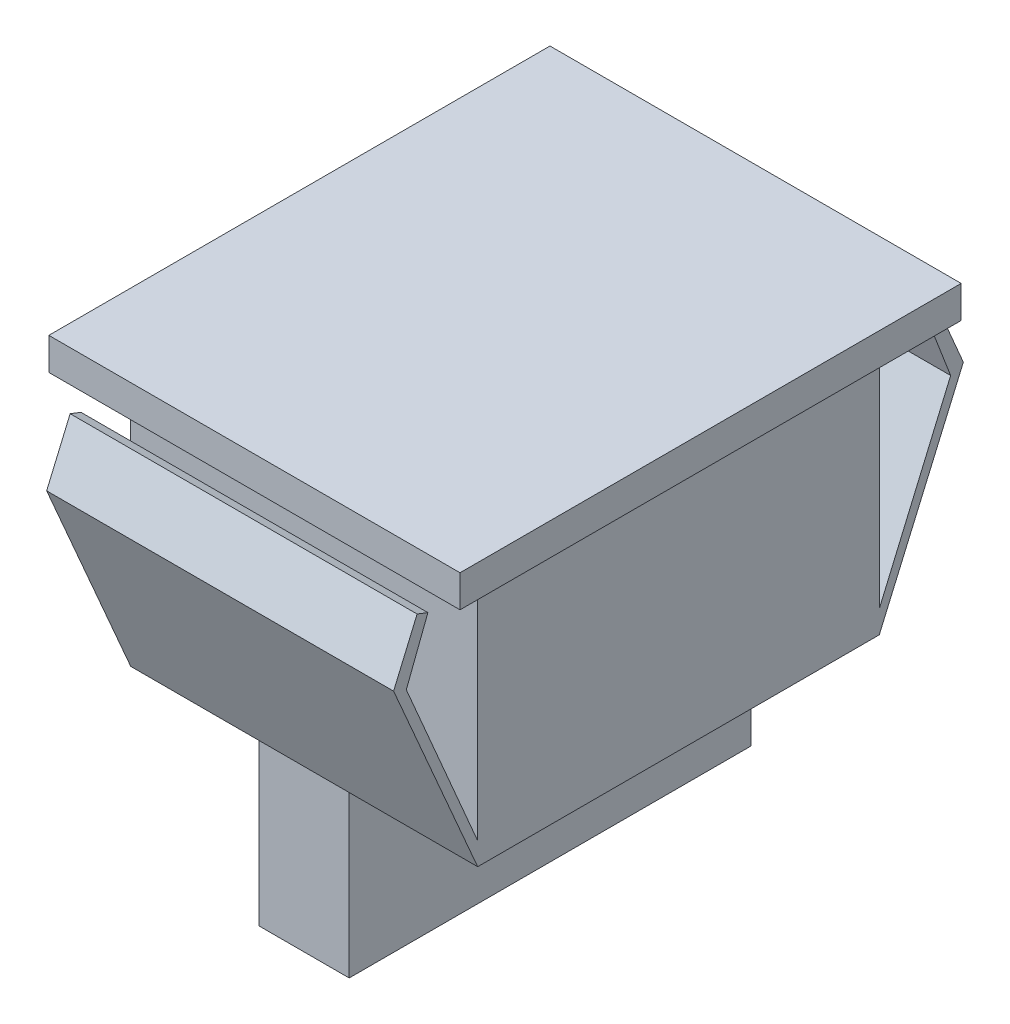
ISO-10303-21;
HEADER;
FILE_DESCRIPTION(('STEP AP214'),'2;1');
FILE_NAME('part.step','',(''),(''),'','','');
FILE_SCHEMA(('AUTOMOTIVE_DESIGN { 1 0 10303 214 1 1 1 1 }'));
ENDSEC;
DATA;
#1=APPLICATION_CONTEXT('core data for automotive mechanical design processes');
#2=APPLICATION_PROTOCOL_DEFINITION('international standard','automotive_design',2000,#1);
#3=PRODUCT_CONTEXT('',#1,'mechanical');
#4=PRODUCT('Part','Part','',(#3));
#5=PRODUCT_RELATED_PRODUCT_CATEGORY('part','',(#4));
#6=PRODUCT_DEFINITION_FORMATION('','',#4);
#7=PRODUCT_DEFINITION_CONTEXT('part definition',#1,'design');
#8=PRODUCT_DEFINITION('design','',#6,#7);
#9=PRODUCT_DEFINITION_SHAPE('','',#8);
#10=(LENGTH_UNIT() NAMED_UNIT(*) SI_UNIT(.MILLI.,.METRE.));
#11=(NAMED_UNIT(*) PLANE_ANGLE_UNIT() SI_UNIT($,.RADIAN.));
#12=(NAMED_UNIT(*) SI_UNIT($,.STERADIAN.) SOLID_ANGLE_UNIT());
#13=UNCERTAINTY_MEASURE_WITH_UNIT(LENGTH_MEASURE(1.E-05),#10,'distance_accuracy_value','');
#14=(GEOMETRIC_REPRESENTATION_CONTEXT(3) GLOBAL_UNCERTAINTY_ASSIGNED_CONTEXT((#13)) GLOBAL_UNIT_ASSIGNED_CONTEXT((#10,
#11,#12)) REPRESENTATION_CONTEXT('',''));
#15=CARTESIAN_POINT('',(0.,0.,0.));
#16=DIRECTION('',(0.,0.,1.));
#17=DIRECTION('',(1.,0.,0.));
#18=AXIS2_PLACEMENT_3D('',#15,#16,#17);
#19=CARTESIAN_POINT('',(25.6,0.,12.5));
#20=DIRECTION('',(0.,0.,-1.));
#21=DIRECTION('',(-1.,0.,0.));
#22=AXIS2_PLACEMENT_3D('',#19,#20,#21);
#23=PLANE('',#22);
#24=DIRECTION('',(0.,-1.,0.));
#25=VECTOR('',#24,1.);
#26=CARTESIAN_POINT('',(15.6,0.,12.5));
#27=LINE('',#26,#25);
#28=CARTESIAN_POINT('',(15.6,10.,12.5));
#29=VERTEX_POINT('',#28);
#30=CARTESIAN_POINT('',(15.6,0.,12.5));
#31=VERTEX_POINT('',#30);
#32=EDGE_CURVE('E405',#29,#31,#27,.T.);
#33=ORIENTED_EDGE('',*,*,#32,.F.);
#34=DIRECTION('',(-1.,0.,0.));
#35=VECTOR('',#34,1.);
#36=CARTESIAN_POINT('',(25.6,10.,12.5));
#37=LINE('',#36,#35);
#38=CARTESIAN_POINT('',(10.,10.,12.5));
#39=VERTEX_POINT('',#38);
#40=EDGE_CURVE('E242',#29,#39,#37,.T.);
#41=ORIENTED_EDGE('',*,*,#40,.T.);
#42=DIRECTION('',(0.,1.,0.));
#43=VECTOR('',#42,1.);
#44=CARTESIAN_POINT('',(10.,0.,12.5));
#45=LINE('',#44,#43);
#46=CARTESIAN_POINT('',(10.,0.,12.5));
#47=VERTEX_POINT('',#46);
#48=EDGE_CURVE('E403',#47,#39,#45,.T.);
#49=ORIENTED_EDGE('',*,*,#48,.F.);
#50=DIRECTION('',(-1.,0.,0.));
#51=VECTOR('',#50,1.);
#52=CARTESIAN_POINT('',(25.6,0.,12.5));
#53=LINE('',#52,#51);
#54=EDGE_CURVE('E301',#31,#47,#53,.T.);
#55=ORIENTED_EDGE('',*,*,#54,.F.);
#56=EDGE_LOOP('',(#33,#41,#49,#55));
#57=FACE_BOUND('',#56,.T.);
#58=ADVANCED_FACE('F34',(#57),#23,.F.);
#59=CARTESIAN_POINT('',(25.6,0.,-12.5));
#60=DIRECTION('',(0.,1.,0.));
#61=DIRECTION('',(0.,0.,1.));
#62=AXIS2_PLACEMENT_3D('',#59,#60,#61);
#63=PLANE('',#62);
#64=DIRECTION('',(0.,0.,1.));
#65=VECTOR('',#64,1.);
#66=CARTESIAN_POINT('',(15.6,0.,-17.7359073275508));
#67=LINE('',#66,#65);
#68=CARTESIAN_POINT('',(15.6,0.,-12.5));
#69=VERTEX_POINT('',#68);
#70=EDGE_CURVE('E320',#69,#31,#67,.T.);
#71=ORIENTED_EDGE('',*,*,#70,.T.);
#72=ORIENTED_EDGE('',*,*,#54,.T.);
#73=DIRECTION('',(0.,0.,1.));
#74=VECTOR('',#73,1.);
#75=CARTESIAN_POINT('',(10.,0.,-17.7359073275508));
#76=LINE('',#75,#74);
#77=CARTESIAN_POINT('',(10.,0.,-12.5));
#78=VERTEX_POINT('',#77);
#79=EDGE_CURVE('E309',#78,#47,#76,.T.);
#80=ORIENTED_EDGE('',*,*,#79,.F.);
#81=DIRECTION('',(-1.,0.,0.));
#82=VECTOR('',#81,1.);
#83=CARTESIAN_POINT('',(25.6,0.,-12.5));
#84=LINE('',#83,#82);
#85=EDGE_CURVE('E298',#69,#78,#84,.T.);
#86=ORIENTED_EDGE('',*,*,#85,.F.);
#87=EDGE_LOOP('',(#71,#72,#80,#86));
#88=FACE_BOUND('',#87,.T.);
#89=ADVANCED_FACE('F318',(#88),#63,.F.);
#90=CARTESIAN_POINT('',(25.6,0.,-12.5));
#91=DIRECTION('',(0.,0.,1.));
#92=DIRECTION('',(1.,0.,0.));
#93=AXIS2_PLACEMENT_3D('',#90,#91,#92);
#94=PLANE('',#93);
#95=DIRECTION('',(0.,1.,0.));
#96=VECTOR('',#95,1.);
#97=CARTESIAN_POINT('',(15.6,0.,-12.5));
#98=LINE('',#97,#96);
#99=CARTESIAN_POINT('',(15.6,10.,-12.5));
#100=VERTEX_POINT('',#99);
#101=EDGE_CURVE('E12',#69,#100,#98,.T.);
#102=ORIENTED_EDGE('',*,*,#101,.F.);
#103=ORIENTED_EDGE('',*,*,#85,.T.);
#104=DIRECTION('',(0.,-1.,0.));
#105=VECTOR('',#104,1.);
#106=CARTESIAN_POINT('',(10.,0.,-12.5));
#107=LINE('',#106,#105);
#108=CARTESIAN_POINT('',(10.,10.,-12.5));
#109=VERTEX_POINT('',#108);
#110=EDGE_CURVE('E42',#109,#78,#107,.T.);
#111=ORIENTED_EDGE('',*,*,#110,.F.);
#112=DIRECTION('',(-1.,0.,0.));
#113=VECTOR('',#112,1.);
#114=CARTESIAN_POINT('',(25.6,10.,-12.5));
#115=LINE('',#114,#113);
#116=EDGE_CURVE('E295',#100,#109,#115,.T.);
#117=ORIENTED_EDGE('',*,*,#116,.F.);
#118=EDGE_LOOP('',(#102,#103,#111,#117));
#119=FACE_BOUND('',#118,.T.);
#120=ADVANCED_FACE('F323',(#119),#94,.F.);
#121=CARTESIAN_POINT('',(25.6,10.,-12.5));
#122=DIRECTION('',(0.,0.39753032988363,0.917589034820389));
#123=DIRECTION('',(0.,-0.917589034820389,0.39753032988363));
#124=AXIS2_PLACEMENT_3D('',#121,#122,#123);
#125=PLANE('',#124);
#126=DIRECTION('',(0.,-0.917589034820389,0.39753032988363));
#127=VECTOR('',#126,1.);
#128=CARTESIAN_POINT('',(2.,10.,-12.5));
#129=LINE('',#128,#127);
#130=CARTESIAN_POINT('',(2.,22.0856467794615,-17.7359073275508));
#131=VERTEX_POINT('',#130);
#132=CARTESIAN_POINT('',(2.,10.,-12.5));
#133=VERTEX_POINT('',#132);
#134=EDGE_CURVE('E399',#131,#133,#129,.T.);
#135=ORIENTED_EDGE('',*,*,#134,.F.);
#136=DIRECTION('',(-1.,0.,0.));
#137=VECTOR('',#136,1.);
#138=CARTESIAN_POINT('',(25.6,22.0856467794615,-17.7359073275508));
#139=LINE('',#138,#137);
#140=CARTESIAN_POINT('',(23.6,22.0856467794615,-17.7359073275508));
#141=VERTEX_POINT('',#140);
#142=EDGE_CURVE('E292',#141,#131,#139,.T.);
#143=ORIENTED_EDGE('',*,*,#142,.F.);
#144=DIRECTION('',(0.,0.917589034820389,-0.39753032988363));
#145=VECTOR('',#144,1.);
#146=CARTESIAN_POINT('',(23.6,10.,-12.5));
#147=LINE('',#146,#145);
#148=CARTESIAN_POINT('',(23.6,10.,-12.5));
#149=VERTEX_POINT('',#148);
#150=EDGE_CURVE('E233',#149,#141,#147,.T.);
#151=ORIENTED_EDGE('',*,*,#150,.F.);
#152=DIRECTION('',(1.,0.,0.));
#153=VECTOR('',#152,1.);
#154=CARTESIAN_POINT('',(25.6,10.,-12.5));
#155=LINE('',#154,#153);
#156=EDGE_CURVE('E334',#100,#149,#155,.T.);
#157=ORIENTED_EDGE('',*,*,#156,.F.);
#158=ORIENTED_EDGE('',*,*,#116,.T.);
#159=DIRECTION('',(1.,0.,0.));
#160=VECTOR('',#159,1.);
#161=CARTESIAN_POINT('',(25.6,10.,-12.5));
#162=LINE('',#161,#160);
#163=EDGE_CURVE('E401',#133,#109,#162,.T.);
#164=ORIENTED_EDGE('',*,*,#163,.F.);
#165=EDGE_LOOP('',(#135,#143,#151,#157,#158,#164));
#166=FACE_BOUND('',#165,.T.);
#167=ADVANCED_FACE('F456',(#166),#125,.F.);
#168=CARTESIAN_POINT('',(25.6,22.0856467794615,-17.7359073275508));
#169=DIRECTION('',(0.,-0.392989074289945,0.91954314063492));
#170=DIRECTION('',(0.,-0.91954314063492,-0.392989074289945));
#171=AXIS2_PLACEMENT_3D('',#168,#169,#170);
#172=PLANE('',#171);
#173=DIRECTION('',(0.,-0.91954314063492,-0.392989074289945));
#174=VECTOR('',#173,1.);
#175=CARTESIAN_POINT('',(2.,22.0856467794615,-17.7359073275508));
#176=LINE('',#175,#174);
#177=CARTESIAN_POINT('',(2.,25.5104759417191,-16.2722234799964));
#178=VERTEX_POINT('',#177);
#179=EDGE_CURVE('E397',#178,#131,#176,.T.);
#180=ORIENTED_EDGE('',*,*,#179,.F.);
#181=DIRECTION('',(-1.,0.,0.));
#182=VECTOR('',#181,1.);
#183=CARTESIAN_POINT('',(25.6,25.5104759417191,-16.2722234799964));
#184=LINE('',#183,#182);
#185=CARTESIAN_POINT('',(23.6,25.5104759417191,-16.2722234799964));
#186=VERTEX_POINT('',#185);
#187=EDGE_CURVE('E289',#186,#178,#184,.T.);
#188=ORIENTED_EDGE('',*,*,#187,.F.);
#189=DIRECTION('',(0.,0.91954314063492,0.392989074289945));
#190=VECTOR('',#189,1.);
#191=CARTESIAN_POINT('',(23.6,22.0856467794615,-17.7359073275508));
#192=LINE('',#191,#190);
#193=EDGE_CURVE('E371',#141,#186,#192,.T.);
#194=ORIENTED_EDGE('',*,*,#193,.F.);
#195=ORIENTED_EDGE('',*,*,#142,.T.);
#196=EDGE_LOOP('',(#180,#188,#194,#195));
#197=FACE_BOUND('',#196,.T.);
#198=ADVANCED_FACE('F466',(#197),#172,.F.);
#199=CARTESIAN_POINT('',(25.6,25.5104759417191,-16.2722234799964));
#200=DIRECTION('',(0.,-0.93314071810577,-0.359511335305367));
#201=DIRECTION('',(0.,0.359511335305367,-0.93314071810577));
#202=AXIS2_PLACEMENT_3D('',#199,#200,#201);
#203=PLANE('',#202);
#204=DIRECTION('',(0.,0.359511335305367,-0.93314071810577));
#205=VECTOR('',#204,1.);
#206=CARTESIAN_POINT('',(2.,25.5104759417191,-16.2722234799964));
#207=LINE('',#206,#205);
#208=CARTESIAN_POINT('',(2.,25.2514882496937,-15.6));
#209=VERTEX_POINT('',#208);
#210=EDGE_CURVE('E395',#209,#178,#207,.T.);
#211=ORIENTED_EDGE('',*,*,#210,.F.);
#212=DIRECTION('',(-1.,0.,0.));
#213=VECTOR('',#212,1.);
#214=CARTESIAN_POINT('',(25.6,25.2514882496937,-15.6));
#215=LINE('',#214,#213);
#216=CARTESIAN_POINT('',(23.6,25.2514882496937,-15.6));
#217=VERTEX_POINT('',#216);
#218=EDGE_CURVE('E286',#217,#209,#215,.T.);
#219=ORIENTED_EDGE('',*,*,#218,.F.);
#220=DIRECTION('',(0.,-0.359511335305367,0.93314071810577));
#221=VECTOR('',#220,1.);
#222=CARTESIAN_POINT('',(23.6,25.5104759417191,-16.2722234799964));
#223=LINE('',#222,#221);
#224=EDGE_CURVE('E369',#186,#217,#223,.T.);
#225=ORIENTED_EDGE('',*,*,#224,.F.);
#226=ORIENTED_EDGE('',*,*,#187,.T.);
#227=EDGE_LOOP('',(#211,#219,#225,#226));
#228=FACE_BOUND('',#227,.T.);
#229=ADVANCED_FACE('F469',(#228),#203,.F.);
#230=CARTESIAN_POINT('',(25.6,25.2514882496937,-15.6));
#231=DIRECTION('',(0.,0.359511335305367,-0.93314071810577));
#232=DIRECTION('',(0.,0.93314071810577,0.359511335305367));
#233=AXIS2_PLACEMENT_3D('',#230,#231,#232);
#234=PLANE('',#233);
#235=DIRECTION('',(0.,0.93314071810577,0.359511335305367));
#236=VECTOR('',#235,1.);
#237=CARTESIAN_POINT('',(2.,25.2514882496937,-15.6));
#238=LINE('',#237,#236);
#239=CARTESIAN_POINT('',(2.,21.7618675381877,-16.9444469599928));
#240=VERTEX_POINT('',#239);
#241=EDGE_CURVE('E393',#240,#209,#238,.T.);
#242=ORIENTED_EDGE('',*,*,#241,.F.);
#243=DIRECTION('',(-1.,0.,0.));
#244=VECTOR('',#243,1.);
#245=CARTESIAN_POINT('',(25.6,21.7618675381877,-16.9444469599928));
#246=LINE('',#245,#244);
#247=CARTESIAN_POINT('',(23.6,21.7618675381877,-16.9444469599928));
#248=VERTEX_POINT('',#247);
#249=EDGE_CURVE('E283',#248,#240,#246,.T.);
#250=ORIENTED_EDGE('',*,*,#249,.F.);
#251=DIRECTION('',(0.,-0.93314071810577,-0.359511335305367));
#252=VECTOR('',#251,1.);
#253=CARTESIAN_POINT('',(23.6,25.2514882496937,-15.6));
#254=LINE('',#253,#252);
#255=EDGE_CURVE('E367',#217,#248,#254,.T.);
#256=ORIENTED_EDGE('',*,*,#255,.F.);
#257=ORIENTED_EDGE('',*,*,#218,.T.);
#258=EDGE_LOOP('',(#242,#250,#256,#257));
#259=FACE_BOUND('',#258,.T.);
#260=ADVANCED_FACE('F476',(#259),#234,.F.);
#261=CARTESIAN_POINT('',(25.6,21.7618675381877,-16.9444469599928));
#262=DIRECTION('',(0.,-0.39422246432121,-0.919015042654097));
#263=DIRECTION('',(0.,0.919015042654097,-0.39422246432121));
#264=AXIS2_PLACEMENT_3D('',#261,#262,#263);
#265=PLANE('',#264);
#266=DIRECTION('',(0.,0.919015042654097,-0.39422246432121));
#267=VECTOR('',#266,1.);
#268=CARTESIAN_POINT('',(2.,21.7618675381877,-16.9444469599928));
#269=LINE('',#268,#267);
#270=CARTESIAN_POINT('',(2.,11.4009318174278,-12.5));
#271=VERTEX_POINT('',#270);
#272=EDGE_CURVE('E391',#271,#240,#269,.T.);
#273=ORIENTED_EDGE('',*,*,#272,.F.);
#274=DIRECTION('',(-1.,0.,0.));
#275=VECTOR('',#274,1.);
#276=CARTESIAN_POINT('',(25.6,11.4009318174278,-12.5));
#277=LINE('',#276,#275);
#278=CARTESIAN_POINT('',(23.6,11.4009318174278,-12.5));
#279=VERTEX_POINT('',#278);
#280=EDGE_CURVE('E280',#279,#271,#277,.T.);
#281=ORIENTED_EDGE('',*,*,#280,.F.);
#282=DIRECTION('',(0.,-0.919015042654097,0.39422246432121));
#283=VECTOR('',#282,1.);
#284=CARTESIAN_POINT('',(23.6,21.7618675381877,-16.9444469599928));
#285=LINE('',#284,#283);
#286=EDGE_CURVE('E365',#248,#279,#285,.T.);
#287=ORIENTED_EDGE('',*,*,#286,.F.);
#288=ORIENTED_EDGE('',*,*,#249,.T.);
#289=EDGE_LOOP('',(#273,#281,#287,#288));
#290=FACE_BOUND('',#289,.T.);
#291=ADVANCED_FACE('F479',(#290),#265,.F.);
#292=CARTESIAN_POINT('',(25.6,11.4009318174278,-12.5));
#293=DIRECTION('',(0.,0.,1.));
#294=DIRECTION('',(0.,-1.,0.));
#295=AXIS2_PLACEMENT_3D('',#292,#293,#294);
#296=PLANE('',#295);
#297=DIRECTION('',(0.,-1.,0.));
#298=VECTOR('',#297,1.);
#299=CARTESIAN_POINT('',(2.,11.4009318174278,-12.5));
#300=LINE('',#299,#298);
#301=CARTESIAN_POINT('',(2.,24.7092218445496,-12.5));
#302=VERTEX_POINT('',#301);
#303=EDGE_CURVE('E389',#302,#271,#300,.T.);
#304=ORIENTED_EDGE('',*,*,#303,.F.);
#305=DIRECTION('',(-1.,0.,0.));
#306=VECTOR('',#305,1.);
#307=CARTESIAN_POINT('',(25.6,24.7092218445496,-12.5));
#308=LINE('',#307,#306);
#309=CARTESIAN_POINT('',(23.6,24.7092218445496,-12.5));
#310=VERTEX_POINT('',#309);
#311=EDGE_CURVE('E277',#310,#302,#308,.T.);
#312=ORIENTED_EDGE('',*,*,#311,.F.);
#313=DIRECTION('',(0.,1.,0.));
#314=VECTOR('',#313,1.);
#315=CARTESIAN_POINT('',(23.6,11.4009318174278,-12.5));
#316=LINE('',#315,#314);
#317=EDGE_CURVE('E363',#279,#310,#316,.T.);
#318=ORIENTED_EDGE('',*,*,#317,.F.);
#319=ORIENTED_EDGE('',*,*,#280,.T.);
#320=EDGE_LOOP('',(#304,#312,#318,#319));
#321=FACE_BOUND('',#320,.T.);
#322=ADVANCED_FACE('F486',(#321),#296,.F.);
#323=CARTESIAN_POINT('',(25.6,24.7092218445496,-12.5));
#324=DIRECTION('',(0.,1.,0.));
#325=DIRECTION('',(0.,0.,1.));
#326=AXIS2_PLACEMENT_3D('',#323,#324,#325);
#327=PLANE('',#326);
#328=DIRECTION('',(0.,0.,1.));
#329=VECTOR('',#328,1.);
#330=CARTESIAN_POINT('',(2.,24.7092218445496,-12.5));
#331=LINE('',#330,#329);
#332=CARTESIAN_POINT('',(2.,24.7092218445496,-13.75));
#333=VERTEX_POINT('',#332);
#334=EDGE_CURVE('E387',#333,#302,#331,.T.);
#335=ORIENTED_EDGE('',*,*,#334,.F.);
#336=DIRECTION('',(-1.,0.,0.));
#337=VECTOR('',#336,1.);
#338=CARTESIAN_POINT('',(25.6,24.7092218445496,-13.75));
#339=LINE('',#338,#337);
#340=CARTESIAN_POINT('',(23.6,24.7092218445496,-13.75));
#341=VERTEX_POINT('',#340);
#342=EDGE_CURVE('E274',#341,#333,#339,.T.);
#343=ORIENTED_EDGE('',*,*,#342,.F.);
#344=DIRECTION('',(0.,0.,-1.));
#345=VECTOR('',#344,1.);
#346=CARTESIAN_POINT('',(23.6,24.7092218445496,-12.5));
#347=LINE('',#346,#345);
#348=EDGE_CURVE('E361',#310,#341,#347,.T.);
#349=ORIENTED_EDGE('',*,*,#348,.F.);
#350=ORIENTED_EDGE('',*,*,#311,.T.);
#351=EDGE_LOOP('',(#335,#343,#349,#350));
#352=FACE_BOUND('',#351,.T.);
#353=ADVANCED_FACE('F489',(#352),#327,.F.);
#354=CARTESIAN_POINT('',(25.6,24.7092218445496,-13.75));
#355=DIRECTION('',(0.,0.,1.));
#356=DIRECTION('',(1.,0.,0.));
#357=AXIS2_PLACEMENT_3D('',#354,#355,#356);
#358=PLANE('',#357);
#359=DIRECTION('',(0.,-1.,0.));
#360=VECTOR('',#359,1.);
#361=CARTESIAN_POINT('',(2.,24.7092218445496,-13.75));
#362=LINE('',#361,#360);
#363=CARTESIAN_POINT('',(2.,26.4,-13.75));
#364=VERTEX_POINT('',#363);
#365=EDGE_CURVE('E385',#364,#333,#362,.T.);
#366=ORIENTED_EDGE('',*,*,#365,.F.);
#367=DIRECTION('',(-1.,0.,0.));
#368=VECTOR('',#367,1.);
#369=CARTESIAN_POINT('',(25.6,26.4,-13.75));
#370=LINE('',#369,#368);
#371=CARTESIAN_POINT('',(23.6,26.4,-13.75));
#372=VERTEX_POINT('',#371);
#373=EDGE_CURVE('E271',#372,#364,#370,.T.);
#374=ORIENTED_EDGE('',*,*,#373,.F.);
#375=DIRECTION('',(0.,1.,0.));
#376=VECTOR('',#375,1.);
#377=CARTESIAN_POINT('',(23.6,24.7092218445496,-13.75));
#378=LINE('',#377,#376);
#379=EDGE_CURVE('E359',#341,#372,#378,.T.);
#380=ORIENTED_EDGE('',*,*,#379,.F.);
#381=ORIENTED_EDGE('',*,*,#342,.T.);
#382=EDGE_LOOP('',(#366,#374,#380,#381));
#383=FACE_BOUND('',#382,.T.);
#384=ADVANCED_FACE('F496',(#383),#358,.F.);
#385=CARTESIAN_POINT('',(25.6,24.7092218445496,13.75));
#386=DIRECTION('',(0.,0.,-1.));
#387=DIRECTION('',(-1.,0.,0.));
#388=AXIS2_PLACEMENT_3D('',#385,#386,#387);
#389=PLANE('',#388);
#390=DIRECTION('',(0.,1.,0.));
#391=VECTOR('',#390,1.);
#392=CARTESIAN_POINT('',(2.,24.7092218445496,13.75));
#393=LINE('',#392,#391);
#394=CARTESIAN_POINT('',(2.,24.7092218445496,13.75));
#395=VERTEX_POINT('',#394);
#396=CARTESIAN_POINT('',(2.,26.4,13.75));
#397=VERTEX_POINT('',#396);
#398=EDGE_CURVE('E383',#395,#397,#393,.T.);
#399=ORIENTED_EDGE('',*,*,#398,.F.);
#400=DIRECTION('',(-1.,0.,0.));
#401=VECTOR('',#400,1.);
#402=CARTESIAN_POINT('',(25.6,24.7092218445496,13.75));
#403=LINE('',#402,#401);
#404=CARTESIAN_POINT('',(23.6,24.7092218445496,13.75));
#405=VERTEX_POINT('',#404);
#406=EDGE_CURVE('E258',#405,#395,#403,.T.);
#407=ORIENTED_EDGE('',*,*,#406,.F.);
#408=DIRECTION('',(0.,-1.,0.));
#409=VECTOR('',#408,1.);
#410=CARTESIAN_POINT('',(23.6,24.7092218445496,13.75));
#411=LINE('',#410,#409);
#412=CARTESIAN_POINT('',(23.6,26.4,13.75));
#413=VERTEX_POINT('',#412);
#414=EDGE_CURVE('E357',#413,#405,#411,.T.);
#415=ORIENTED_EDGE('',*,*,#414,.F.);
#416=DIRECTION('',(-1.,0.,0.));
#417=VECTOR('',#416,1.);
#418=CARTESIAN_POINT('',(25.6,26.4,13.75));
#419=LINE('',#418,#417);
#420=EDGE_CURVE('E261',#413,#397,#419,.T.);
#421=ORIENTED_EDGE('',*,*,#420,.T.);
#422=EDGE_LOOP('',(#399,#407,#415,#421));
#423=FACE_BOUND('',#422,.T.);
#424=ADVANCED_FACE('F507',(#423),#389,.F.);
#425=CARTESIAN_POINT('',(25.6,24.7092218445496,12.5));
#426=DIRECTION('',(0.,1.,0.));
#427=DIRECTION('',(0.,0.,1.));
#428=AXIS2_PLACEMENT_3D('',#425,#426,#427);
#429=PLANE('',#428);
#430=DIRECTION('',(0.,0.,1.));
#431=VECTOR('',#430,1.);
#432=CARTESIAN_POINT('',(2.,24.7092218445496,12.5));
#433=LINE('',#432,#431);
#434=CARTESIAN_POINT('',(2.,24.7092218445496,12.5));
#435=VERTEX_POINT('',#434);
#436=EDGE_CURVE('E381',#435,#395,#433,.T.);
#437=ORIENTED_EDGE('',*,*,#436,.F.);
#438=DIRECTION('',(-1.,0.,0.));
#439=VECTOR('',#438,1.);
#440=CARTESIAN_POINT('',(25.6,24.7092218445496,12.5));
#441=LINE('',#440,#439);
#442=CARTESIAN_POINT('',(23.6,24.7092218445496,12.5));
#443=VERTEX_POINT('',#442);
#444=EDGE_CURVE('E255',#443,#435,#441,.T.);
#445=ORIENTED_EDGE('',*,*,#444,.F.);
#446=DIRECTION('',(0.,0.,-1.));
#447=VECTOR('',#446,1.);
#448=CARTESIAN_POINT('',(23.6,24.7092218445496,12.5));
#449=LINE('',#448,#447);
#450=EDGE_CURVE('E355',#405,#443,#449,.T.);
#451=ORIENTED_EDGE('',*,*,#450,.F.);
#452=ORIENTED_EDGE('',*,*,#406,.T.);
#453=EDGE_LOOP('',(#437,#445,#451,#452));
#454=FACE_BOUND('',#453,.T.);
#455=ADVANCED_FACE('F510',(#454),#429,.F.);
#456=CARTESIAN_POINT('',(25.6,11.4009318174278,12.5));
#457=DIRECTION('',(0.,0.,-1.));
#458=DIRECTION('',(0.,1.,0.));
#459=AXIS2_PLACEMENT_3D('',#456,#457,#458);
#460=PLANE('',#459);
#461=DIRECTION('',(0.,1.,0.));
#462=VECTOR('',#461,1.);
#463=CARTESIAN_POINT('',(2.,11.4009318174278,12.5));
#464=LINE('',#463,#462);
#465=CARTESIAN_POINT('',(2.,11.4009318174278,12.5));
#466=VERTEX_POINT('',#465);
#467=EDGE_CURVE('E379',#466,#435,#464,.T.);
#468=ORIENTED_EDGE('',*,*,#467,.F.);
#469=DIRECTION('',(-1.,0.,0.));
#470=VECTOR('',#469,1.);
#471=CARTESIAN_POINT('',(25.6,11.4009318174278,12.5));
#472=LINE('',#471,#470);
#473=CARTESIAN_POINT('',(23.6,11.4009318174278,12.5));
#474=VERTEX_POINT('',#473);
#475=EDGE_CURVE('E252',#474,#466,#472,.T.);
#476=ORIENTED_EDGE('',*,*,#475,.F.);
#477=DIRECTION('',(0.,-1.,0.));
#478=VECTOR('',#477,1.);
#479=CARTESIAN_POINT('',(23.6,11.4009318174278,12.5));
#480=LINE('',#479,#478);
#481=EDGE_CURVE('E353',#443,#474,#480,.T.);
#482=ORIENTED_EDGE('',*,*,#481,.F.);
#483=ORIENTED_EDGE('',*,*,#444,.T.);
#484=EDGE_LOOP('',(#468,#476,#482,#483));
#485=FACE_BOUND('',#484,.T.);
#486=ADVANCED_FACE('F517',(#485),#460,.F.);
#487=CARTESIAN_POINT('',(25.6,21.7618675381877,16.9444469599928));
#488=DIRECTION('',(0.,-0.39422246432121,0.919015042654097));
#489=DIRECTION('',(0.,-0.919015042654097,-0.39422246432121));
#490=AXIS2_PLACEMENT_3D('',#487,#488,#489);
#491=PLANE('',#490);
#492=DIRECTION('',(0.,-0.919015042654097,-0.39422246432121));
#493=VECTOR('',#492,1.);
#494=CARTESIAN_POINT('',(2.,21.7618675381877,16.9444469599928));
#495=LINE('',#494,#493);
#496=CARTESIAN_POINT('',(2.,21.7618675381877,16.9444469599928));
#497=VERTEX_POINT('',#496);
#498=EDGE_CURVE('E377',#497,#466,#495,.T.);
#499=ORIENTED_EDGE('',*,*,#498,.F.);
#500=DIRECTION('',(-1.,0.,0.));
#501=VECTOR('',#500,1.);
#502=CARTESIAN_POINT('',(25.6,21.7618675381877,16.9444469599928));
#503=LINE('',#502,#501);
#504=CARTESIAN_POINT('',(23.6,21.7618675381877,16.9444469599928));
#505=VERTEX_POINT('',#504);
#506=EDGE_CURVE('E249',#505,#497,#503,.T.);
#507=ORIENTED_EDGE('',*,*,#506,.F.);
#508=DIRECTION('',(0.,0.919015042654097,0.39422246432121));
#509=VECTOR('',#508,1.);
#510=CARTESIAN_POINT('',(23.6,21.7618675381877,16.9444469599928));
#511=LINE('',#510,#509);
#512=EDGE_CURVE('E351',#474,#505,#511,.T.);
#513=ORIENTED_EDGE('',*,*,#512,.F.);
#514=ORIENTED_EDGE('',*,*,#475,.T.);
#515=EDGE_LOOP('',(#499,#507,#513,#514));
#516=FACE_BOUND('',#515,.T.);
#517=ADVANCED_FACE('F520',(#516),#491,.F.);
#518=CARTESIAN_POINT('',(25.6,25.2514882496937,15.6));
#519=DIRECTION('',(0.,0.359511335305367,0.93314071810577));
#520=DIRECTION('',(0.,-0.93314071810577,0.359511335305367));
#521=AXIS2_PLACEMENT_3D('',#518,#519,#520);
#522=PLANE('',#521);
#523=DIRECTION('',(0.,-0.93314071810577,0.359511335305367));
#524=VECTOR('',#523,1.);
#525=CARTESIAN_POINT('',(2.,25.2514882496937,15.6));
#526=LINE('',#525,#524);
#527=CARTESIAN_POINT('',(2.,25.2514882496937,15.6));
#528=VERTEX_POINT('',#527);
#529=EDGE_CURVE('E375',#528,#497,#526,.T.);
#530=ORIENTED_EDGE('',*,*,#529,.F.);
#531=DIRECTION('',(-1.,0.,0.));
#532=VECTOR('',#531,1.);
#533=CARTESIAN_POINT('',(25.6,25.2514882496937,15.6));
#534=LINE('',#533,#532);
#535=CARTESIAN_POINT('',(23.6,25.2514882496937,15.6));
#536=VERTEX_POINT('',#535);
#537=EDGE_CURVE('E240',#536,#528,#534,.T.);
#538=ORIENTED_EDGE('',*,*,#537,.F.);
#539=DIRECTION('',(0.,0.93314071810577,-0.359511335305367));
#540=VECTOR('',#539,1.);
#541=CARTESIAN_POINT('',(23.6,25.2514882496937,15.6));
#542=LINE('',#541,#540);
#543=EDGE_CURVE('E349',#505,#536,#542,.T.);
#544=ORIENTED_EDGE('',*,*,#543,.F.);
#545=ORIENTED_EDGE('',*,*,#506,.T.);
#546=EDGE_LOOP('',(#530,#538,#544,#545));
#547=FACE_BOUND('',#546,.T.);
#548=ADVANCED_FACE('F527',(#547),#522,.F.);
#549=CARTESIAN_POINT('',(25.6,25.5104759417191,16.2722234799964));
#550=DIRECTION('',(0.,-0.93314071810577,0.359511335305367));
#551=DIRECTION('',(0.,-0.359511335305367,-0.93314071810577));
#552=AXIS2_PLACEMENT_3D('',#549,#550,#551);
#553=PLANE('',#552);
#554=DIRECTION('',(0.,-0.359511335305367,-0.93314071810577));
#555=VECTOR('',#554,1.);
#556=CARTESIAN_POINT('',(2.,25.5104759417191,16.2722234799964));
#557=LINE('',#556,#555);
#558=CARTESIAN_POINT('',(2.,25.5104759417191,16.2722234799964));
#559=VERTEX_POINT('',#558);
#560=EDGE_CURVE('E232',#559,#528,#557,.T.);
#561=ORIENTED_EDGE('',*,*,#560,.F.);
#562=DIRECTION('',(-1.,0.,0.));
#563=VECTOR('',#562,1.);
#564=CARTESIAN_POINT('',(25.6,25.5104759417191,16.2722234799964));
#565=LINE('',#564,#563);
#566=CARTESIAN_POINT('',(23.6,25.5104759417191,16.2722234799964));
#567=VERTEX_POINT('',#566);
#568=EDGE_CURVE('E231',#567,#559,#565,.T.);
#569=ORIENTED_EDGE('',*,*,#568,.F.);
#570=DIRECTION('',(0.,0.359511335305367,0.93314071810577));
#571=VECTOR('',#570,1.);
#572=CARTESIAN_POINT('',(23.6,25.5104759417191,16.2722234799964));
#573=LINE('',#572,#571);
#574=EDGE_CURVE('E347',#536,#567,#573,.T.);
#575=ORIENTED_EDGE('',*,*,#574,.F.);
#576=ORIENTED_EDGE('',*,*,#537,.T.);
#577=EDGE_LOOP('',(#561,#569,#575,#576));
#578=FACE_BOUND('',#577,.T.);
#579=ADVANCED_FACE('F529',(#578),#553,.F.);
#580=CARTESIAN_POINT('',(25.6,22.0856467794615,17.7359073275508));
#581=DIRECTION('',(0.,-0.392989074289945,-0.91954314063492));
#582=DIRECTION('',(0.,0.91954314063492,-0.392989074289945));
#583=AXIS2_PLACEMENT_3D('',#580,#581,#582);
#584=PLANE('',#583);
#585=DIRECTION('',(0.,0.91954314063492,-0.392989074289945));
#586=VECTOR('',#585,1.);
#587=CARTESIAN_POINT('',(2.,22.0856467794615,17.7359073275508));
#588=LINE('',#587,#586);
#589=CARTESIAN_POINT('',(2.,22.0856467794615,17.7359073275508));
#590=VERTEX_POINT('',#589);
#591=EDGE_CURVE('E215',#590,#559,#588,.T.);
#592=ORIENTED_EDGE('',*,*,#591,.F.);
#593=DIRECTION('',(-1.,0.,0.));
#594=VECTOR('',#593,1.);
#595=CARTESIAN_POINT('',(25.6,22.0856467794615,17.7359073275508));
#596=LINE('',#595,#594);
#597=CARTESIAN_POINT('',(23.6,22.0856467794615,17.7359073275508));
#598=VERTEX_POINT('',#597);
#599=EDGE_CURVE('E229',#598,#590,#596,.T.);
#600=ORIENTED_EDGE('',*,*,#599,.F.);
#601=DIRECTION('',(0.,-0.91954314063492,0.392989074289945));
#602=VECTOR('',#601,1.);
#603=CARTESIAN_POINT('',(23.6,22.0856467794615,17.7359073275508));
#604=LINE('',#603,#602);
#605=EDGE_CURVE('E345',#567,#598,#604,.T.);
#606=ORIENTED_EDGE('',*,*,#605,.F.);
#607=ORIENTED_EDGE('',*,*,#568,.T.);
#608=EDGE_LOOP('',(#592,#600,#606,#607));
#609=FACE_BOUND('',#608,.T.);
#610=ADVANCED_FACE('F227',(#609),#584,.F.);
#611=CARTESIAN_POINT('',(25.6,10.,12.5));
#612=DIRECTION('',(0.,0.39753032988363,-0.917589034820389));
#613=DIRECTION('',(0.,0.917589034820389,0.39753032988363));
#614=AXIS2_PLACEMENT_3D('',#611,#612,#613);
#615=PLANE('',#614);
#616=DIRECTION('',(0.,0.917589034820389,0.39753032988363));
#617=VECTOR('',#616,1.);
#618=CARTESIAN_POINT('',(2.,10.,12.5));
#619=LINE('',#618,#617);
#620=CARTESIAN_POINT('',(2.,10.,12.5));
#621=VERTEX_POINT('',#620);
#622=EDGE_CURVE('E212',#621,#590,#619,.T.);
#623=ORIENTED_EDGE('',*,*,#622,.F.);
#624=EDGE_CURVE('E244',#39,#621,#37,.T.);
#625=ORIENTED_EDGE('',*,*,#624,.F.);
#626=ORIENTED_EDGE('',*,*,#40,.F.);
#627=CARTESIAN_POINT('',(23.6,10.,12.5));
#628=VERTEX_POINT('',#627);
#629=EDGE_CURVE('E238',#628,#29,#37,.T.);
#630=ORIENTED_EDGE('',*,*,#629,.F.);
#631=DIRECTION('',(0.,-0.917589034820389,-0.39753032988363));
#632=VECTOR('',#631,1.);
#633=CARTESIAN_POINT('',(23.6,10.,12.5));
#634=LINE('',#633,#632);
#635=EDGE_CURVE('E222',#598,#628,#634,.T.);
#636=ORIENTED_EDGE('',*,*,#635,.F.);
#637=ORIENTED_EDGE('',*,*,#599,.T.);
#638=EDGE_LOOP('',(#623,#625,#626,#630,#636,#637));
#639=FACE_BOUND('',#638,.T.);
#640=ADVANCED_FACE('F236',(#639),#615,.F.);
#641=CARTESIAN_POINT('',(25.6,0.,0.));
#642=DIRECTION('',(1.,0.,0.));
#643=DIRECTION('',(0.,0.,-1.));
#644=AXIS2_PLACEMENT_3D('',#641,#642,#643);
#645=PLANE('',#644);
#646=DIRECTION('',(0.,-1.,0.));
#647=VECTOR('',#646,1.);
#648=CARTESIAN_POINT('',(25.6,26.4,15.6));
#649=LINE('',#648,#647);
#650=CARTESIAN_POINT('',(25.6,28.4,15.6));
#651=VERTEX_POINT('',#650);
#652=CARTESIAN_POINT('',(25.6,26.4,15.6));
#653=VERTEX_POINT('',#652);
#654=EDGE_CURVE('E414',#651,#653,#649,.T.);
#655=ORIENTED_EDGE('',*,*,#654,.T.);
#656=DIRECTION('',(0.,0.,-1.));
#657=VECTOR('',#656,1.);
#658=CARTESIAN_POINT('',(25.6,26.4,-13.75));
#659=LINE('',#658,#657);
#660=CARTESIAN_POINT('',(25.6,26.4,-15.6));
#661=VERTEX_POINT('',#660);
#662=EDGE_CURVE('E50',#653,#661,#659,.T.);
#663=ORIENTED_EDGE('',*,*,#662,.T.);
#664=DIRECTION('',(0.,1.,0.));
#665=VECTOR('',#664,1.);
#666=CARTESIAN_POINT('',(25.6,26.4,-15.6));
#667=LINE('',#666,#665);
#668=CARTESIAN_POINT('',(25.6,28.4,-15.6));
#669=VERTEX_POINT('',#668);
#670=EDGE_CURVE('E409',#661,#669,#667,.T.);
#671=ORIENTED_EDGE('',*,*,#670,.T.);
#672=DIRECTION('',(0.,0.,1.));
#673=VECTOR('',#672,1.);
#674=CARTESIAN_POINT('',(25.6,28.4,15.6));
#675=LINE('',#674,#673);
#676=EDGE_CURVE('E412',#669,#651,#675,.T.);
#677=ORIENTED_EDGE('',*,*,#676,.T.);
#678=EDGE_LOOP('',(#655,#663,#671,#677));
#679=FACE_BOUND('',#678,.T.);
#680=ADVANCED_FACE('F432',(#679),#645,.T.);
#681=CARTESIAN_POINT('',(0.,0.,0.));
#682=DIRECTION('',(1.,0.,0.));
#683=DIRECTION('',(0.,0.,-1.));
#684=AXIS2_PLACEMENT_3D('',#681,#682,#683);
#685=PLANE('',#684);
#686=DIRECTION('',(0.,1.,0.));
#687=VECTOR('',#686,1.);
#688=CARTESIAN_POINT('',(0.,26.4,-15.6));
#689=LINE('',#688,#687);
#690=CARTESIAN_POINT('',(0.,26.4,-15.6));
#691=VERTEX_POINT('',#690);
#692=CARTESIAN_POINT('',(0.,28.4,-15.6));
#693=VERTEX_POINT('',#692);
#694=EDGE_CURVE('E407',#691,#693,#689,.T.);
#695=ORIENTED_EDGE('',*,*,#694,.F.);
#696=DIRECTION('',(0.,0.,-1.));
#697=VECTOR('',#696,1.);
#698=CARTESIAN_POINT('',(0.,26.4,13.75));
#699=LINE('',#698,#697);
#700=CARTESIAN_POINT('',(0.,26.4,15.6));
#701=VERTEX_POINT('',#700);
#702=EDGE_CURVE('E410',#701,#691,#699,.T.);
#703=ORIENTED_EDGE('',*,*,#702,.F.);
#704=DIRECTION('',(0.,-1.,0.));
#705=VECTOR('',#704,1.);
#706=CARTESIAN_POINT('',(0.,26.4,15.6));
#707=LINE('',#706,#705);
#708=CARTESIAN_POINT('',(0.,28.4,15.6));
#709=VERTEX_POINT('',#708);
#710=EDGE_CURVE('E418',#709,#701,#707,.T.);
#711=ORIENTED_EDGE('',*,*,#710,.F.);
#712=DIRECTION('',(0.,0.,1.));
#713=VECTOR('',#712,1.);
#714=CARTESIAN_POINT('',(0.,28.4,15.6));
#715=LINE('',#714,#713);
#716=EDGE_CURVE('E69',#693,#709,#715,.T.);
#717=ORIENTED_EDGE('',*,*,#716,.F.);
#718=EDGE_LOOP('',(#695,#703,#711,#717));
#719=FACE_BOUND('',#718,.T.);
#720=ADVANCED_FACE('F425',(#719),#685,.F.);
#721=CARTESIAN_POINT('',(25.6,26.4,-15.6));
#722=DIRECTION('',(0.,0.,1.));
#723=DIRECTION('',(1.,0.,0.));
#724=AXIS2_PLACEMENT_3D('',#721,#722,#723);
#725=PLANE('',#724);
#726=ORIENTED_EDGE('',*,*,#694,.T.);
#727=DIRECTION('',(-1.,0.,0.));
#728=VECTOR('',#727,1.);
#729=CARTESIAN_POINT('',(25.6,28.4,-15.6));
#730=LINE('',#729,#728);
#731=EDGE_CURVE('E267',#669,#693,#730,.T.);
#732=ORIENTED_EDGE('',*,*,#731,.F.);
#733=ORIENTED_EDGE('',*,*,#670,.F.);
#734=DIRECTION('',(-1.,0.,0.));
#735=VECTOR('',#734,1.);
#736=CARTESIAN_POINT('',(25.6,26.4,-15.6));
#737=LINE('',#736,#735);
#738=EDGE_CURVE('E269',#661,#691,#737,.T.);
#739=ORIENTED_EDGE('',*,*,#738,.T.);
#740=EDGE_LOOP('',(#726,#732,#733,#739));
#741=FACE_BOUND('',#740,.T.);
#742=ADVANCED_FACE('F428',(#741),#725,.F.);
#743=CARTESIAN_POINT('',(25.6,28.4,15.6));
#744=DIRECTION('',(0.,-1.,0.));
#745=DIRECTION('',(0.,0.,-1.));
#746=AXIS2_PLACEMENT_3D('',#743,#744,#745);
#747=PLANE('',#746);
#748=ORIENTED_EDGE('',*,*,#716,.T.);
#749=DIRECTION('',(-1.,0.,0.));
#750=VECTOR('',#749,1.);
#751=CARTESIAN_POINT('',(25.6,28.4,15.6));
#752=LINE('',#751,#750);
#753=EDGE_CURVE('E265',#651,#709,#752,.T.);
#754=ORIENTED_EDGE('',*,*,#753,.F.);
#755=ORIENTED_EDGE('',*,*,#676,.F.);
#756=ORIENTED_EDGE('',*,*,#731,.T.);
#757=EDGE_LOOP('',(#748,#754,#755,#756));
#758=FACE_BOUND('',#757,.T.);
#759=ADVANCED_FACE('F430',(#758),#747,.F.);
#760=CARTESIAN_POINT('',(25.6,26.4,15.6));
#761=DIRECTION('',(0.,0.,-1.));
#762=DIRECTION('',(-1.,0.,0.));
#763=AXIS2_PLACEMENT_3D('',#760,#761,#762);
#764=PLANE('',#763);
#765=ORIENTED_EDGE('',*,*,#710,.T.);
#766=DIRECTION('',(-1.,0.,0.));
#767=VECTOR('',#766,1.);
#768=CARTESIAN_POINT('',(25.6,26.4,15.6));
#769=LINE('',#768,#767);
#770=EDGE_CURVE('E74',#653,#701,#769,.T.);
#771=ORIENTED_EDGE('',*,*,#770,.F.);
#772=ORIENTED_EDGE('',*,*,#654,.F.);
#773=ORIENTED_EDGE('',*,*,#753,.T.);
#774=EDGE_LOOP('',(#765,#771,#772,#773));
#775=FACE_BOUND('',#774,.T.);
#776=ADVANCED_FACE('F434',(#775),#764,.F.);
#777=CARTESIAN_POINT('',(25.6,26.4,13.75));
#778=DIRECTION('',(0.,1.,0.));
#779=DIRECTION('',(0.,0.,1.));
#780=AXIS2_PLACEMENT_3D('',#777,#778,#779);
#781=PLANE('',#780);
#782=ORIENTED_EDGE('',*,*,#373,.T.);
#783=DIRECTION('',(0.,0.,1.));
#784=VECTOR('',#783,1.);
#785=CARTESIAN_POINT('',(2.,26.4,-17.7359073275508));
#786=LINE('',#785,#784);
#787=EDGE_CURVE('E499',#364,#397,#786,.T.);
#788=ORIENTED_EDGE('',*,*,#787,.T.);
#789=ORIENTED_EDGE('',*,*,#420,.F.);
#790=DIRECTION('',(0.,0.,1.));
#791=VECTOR('',#790,1.);
#792=CARTESIAN_POINT('',(23.6,26.4,-17.7359073275508));
#793=LINE('',#792,#791);
#794=EDGE_CURVE('E338',#372,#413,#793,.T.);
#795=ORIENTED_EDGE('',*,*,#794,.F.);
#796=EDGE_LOOP('',(#782,#788,#789,#795));
#797=FACE_BOUND('',#796,.T.);
#798=ORIENTED_EDGE('',*,*,#770,.T.);
#799=ORIENTED_EDGE('',*,*,#702,.T.);
#800=ORIENTED_EDGE('',*,*,#738,.F.);
#801=ORIENTED_EDGE('',*,*,#662,.F.);
#802=EDGE_LOOP('',(#798,#799,#800,#801));
#803=FACE_BOUND('',#802,.T.);
#804=ADVANCED_FACE('F421',(#797,#803),#781,.F.);
#805=CARTESIAN_POINT('',(2.,10.,-17.7359073275508));
#806=DIRECTION('',(-1.,0.,0.));
#807=DIRECTION('',(0.,-1.,0.));
#808=AXIS2_PLACEMENT_3D('',#805,#806,#807);
#809=PLANE('',#808);
#810=ORIENTED_EDGE('',*,*,#134,.T.);
#811=DIRECTION('',(0.,0.,1.));
#812=VECTOR('',#811,1.);
#813=CARTESIAN_POINT('',(2.,10.,-17.7359073275508));
#814=LINE('',#813,#812);
#815=EDGE_CURVE('E218',#133,#621,#814,.T.);
#816=ORIENTED_EDGE('',*,*,#815,.T.);
#817=ORIENTED_EDGE('',*,*,#622,.T.);
#818=ORIENTED_EDGE('',*,*,#591,.T.);
#819=ORIENTED_EDGE('',*,*,#560,.T.);
#820=ORIENTED_EDGE('',*,*,#529,.T.);
#821=ORIENTED_EDGE('',*,*,#498,.T.);
#822=ORIENTED_EDGE('',*,*,#467,.T.);
#823=ORIENTED_EDGE('',*,*,#436,.T.);
#824=ORIENTED_EDGE('',*,*,#398,.T.);
#825=ORIENTED_EDGE('',*,*,#787,.F.);
#826=ORIENTED_EDGE('',*,*,#365,.T.);
#827=ORIENTED_EDGE('',*,*,#334,.T.);
#828=ORIENTED_EDGE('',*,*,#303,.T.);
#829=ORIENTED_EDGE('',*,*,#272,.T.);
#830=ORIENTED_EDGE('',*,*,#241,.T.);
#831=ORIENTED_EDGE('',*,*,#210,.T.);
#832=ORIENTED_EDGE('',*,*,#179,.T.);
#833=EDGE_LOOP('',(#810,#816,#817,#818,#819,#820,#821,#822,#823,#824,#825,#826,#827,#828,#829,
#830,#831,#832));
#834=FACE_BOUND('',#833,.T.);
#835=ADVANCED_FACE('F214',(#834),#809,.T.);
#836=CARTESIAN_POINT('',(2.,10.,-17.7359073275508));
#837=DIRECTION('',(0.,-1.,0.));
#838=DIRECTION('',(0.,0.,-1.));
#839=AXIS2_PLACEMENT_3D('',#836,#837,#838);
#840=PLANE('',#839);
#841=ORIENTED_EDGE('',*,*,#163,.T.);
#842=DIRECTION('',(0.,0.,1.));
#843=VECTOR('',#842,1.);
#844=CARTESIAN_POINT('',(10.,10.,-17.7359073275508));
#845=LINE('',#844,#843);
#846=EDGE_CURVE('E312',#109,#39,#845,.T.);
#847=ORIENTED_EDGE('',*,*,#846,.T.);
#848=ORIENTED_EDGE('',*,*,#624,.T.);
#849=ORIENTED_EDGE('',*,*,#815,.F.);
#850=EDGE_LOOP('',(#841,#847,#848,#849));
#851=FACE_BOUND('',#850,.T.);
#852=ADVANCED_FACE('F452',(#851),#840,.T.);
#853=CARTESIAN_POINT('',(10.,10.,-17.7359073275508));
#854=DIRECTION('',(-1.,0.,0.));
#855=DIRECTION('',(0.,-1.,0.));
#856=AXIS2_PLACEMENT_3D('',#853,#854,#855);
#857=PLANE('',#856);
#858=ORIENTED_EDGE('',*,*,#48,.T.);
#859=ORIENTED_EDGE('',*,*,#846,.F.);
#860=ORIENTED_EDGE('',*,*,#110,.T.);
#861=ORIENTED_EDGE('',*,*,#79,.T.);
#862=EDGE_LOOP('',(#858,#859,#860,#861));
#863=FACE_BOUND('',#862,.T.);
#864=ADVANCED_FACE('F308',(#863),#857,.T.);
#865=CARTESIAN_POINT('',(15.6,10.,-17.7359073275508));
#866=DIRECTION('',(1.,0.,0.));
#867=DIRECTION('',(0.,0.,-1.));
#868=AXIS2_PLACEMENT_3D('',#865,#866,#867);
#869=PLANE('',#868);
#870=ORIENTED_EDGE('',*,*,#32,.T.);
#871=ORIENTED_EDGE('',*,*,#70,.F.);
#872=ORIENTED_EDGE('',*,*,#101,.T.);
#873=DIRECTION('',(0.,0.,1.));
#874=VECTOR('',#873,1.);
#875=CARTESIAN_POINT('',(15.6,10.,-17.7359073275508));
#876=LINE('',#875,#874);
#877=EDGE_CURVE('E329',#100,#29,#876,.T.);
#878=ORIENTED_EDGE('',*,*,#877,.T.);
#879=EDGE_LOOP('',(#870,#871,#872,#878));
#880=FACE_BOUND('',#879,.T.);
#881=ADVANCED_FACE('F328',(#880),#869,.T.);
#882=CARTESIAN_POINT('',(23.6,10.,-17.7359073275508));
#883=DIRECTION('',(1.,0.,0.));
#884=DIRECTION('',(0.,0.,-1.));
#885=AXIS2_PLACEMENT_3D('',#882,#883,#884);
#886=PLANE('',#885);
#887=ORIENTED_EDGE('',*,*,#150,.T.);
#888=ORIENTED_EDGE('',*,*,#193,.T.);
#889=ORIENTED_EDGE('',*,*,#224,.T.);
#890=ORIENTED_EDGE('',*,*,#255,.T.);
#891=ORIENTED_EDGE('',*,*,#286,.T.);
#892=ORIENTED_EDGE('',*,*,#317,.T.);
#893=ORIENTED_EDGE('',*,*,#348,.T.);
#894=ORIENTED_EDGE('',*,*,#379,.T.);
#895=ORIENTED_EDGE('',*,*,#794,.T.);
#896=ORIENTED_EDGE('',*,*,#414,.T.);
#897=ORIENTED_EDGE('',*,*,#450,.T.);
#898=ORIENTED_EDGE('',*,*,#481,.T.);
#899=ORIENTED_EDGE('',*,*,#512,.T.);
#900=ORIENTED_EDGE('',*,*,#543,.T.);
#901=ORIENTED_EDGE('',*,*,#574,.T.);
#902=ORIENTED_EDGE('',*,*,#605,.T.);
#903=ORIENTED_EDGE('',*,*,#635,.T.);
#904=DIRECTION('',(0.,0.,1.));
#905=VECTOR('',#904,1.);
#906=CARTESIAN_POINT('',(23.6,10.,-17.7359073275508));
#907=LINE('',#906,#905);
#908=EDGE_CURVE('E336',#149,#628,#907,.T.);
#909=ORIENTED_EDGE('',*,*,#908,.F.);
#910=EDGE_LOOP('',(#887,#888,#889,#890,#891,#892,#893,#894,#895,#896,#897,#898,#899,#900,#901,
#902,#903,#909));
#911=FACE_BOUND('',#910,.T.);
#912=ADVANCED_FACE('F461',(#911),#886,.T.);
#913=CARTESIAN_POINT('',(23.6,10.,-17.7359073275508));
#914=DIRECTION('',(0.,-1.,0.));
#915=DIRECTION('',(0.,0.,-1.));
#916=AXIS2_PLACEMENT_3D('',#913,#914,#915);
#917=PLANE('',#916);
#918=ORIENTED_EDGE('',*,*,#156,.T.);
#919=ORIENTED_EDGE('',*,*,#908,.T.);
#920=ORIENTED_EDGE('',*,*,#629,.T.);
#921=ORIENTED_EDGE('',*,*,#877,.F.);
#922=EDGE_LOOP('',(#918,#919,#920,#921));
#923=FACE_BOUND('',#922,.T.);
#924=ADVANCED_FACE('F332',(#923),#917,.T.);
#925=CLOSED_SHELL('',(#58,#89,#120,#167,#198,#229,#260,#291,#322,#353,#384,#424,#455,#486,#517,
#548,#579,#610,#640,#680,#720,#742,#759,#776,#804,#835,#852,#864,#881,#912,#924));
#926=MANIFOLD_SOLID_BREP('B2',#925);
#927=ADVANCED_BREP_SHAPE_REPRESENTATION('',(#18,#926),#14);
#928=SHAPE_DEFINITION_REPRESENTATION(#9,#927);
ENDSEC;
END-ISO-10303-21;
